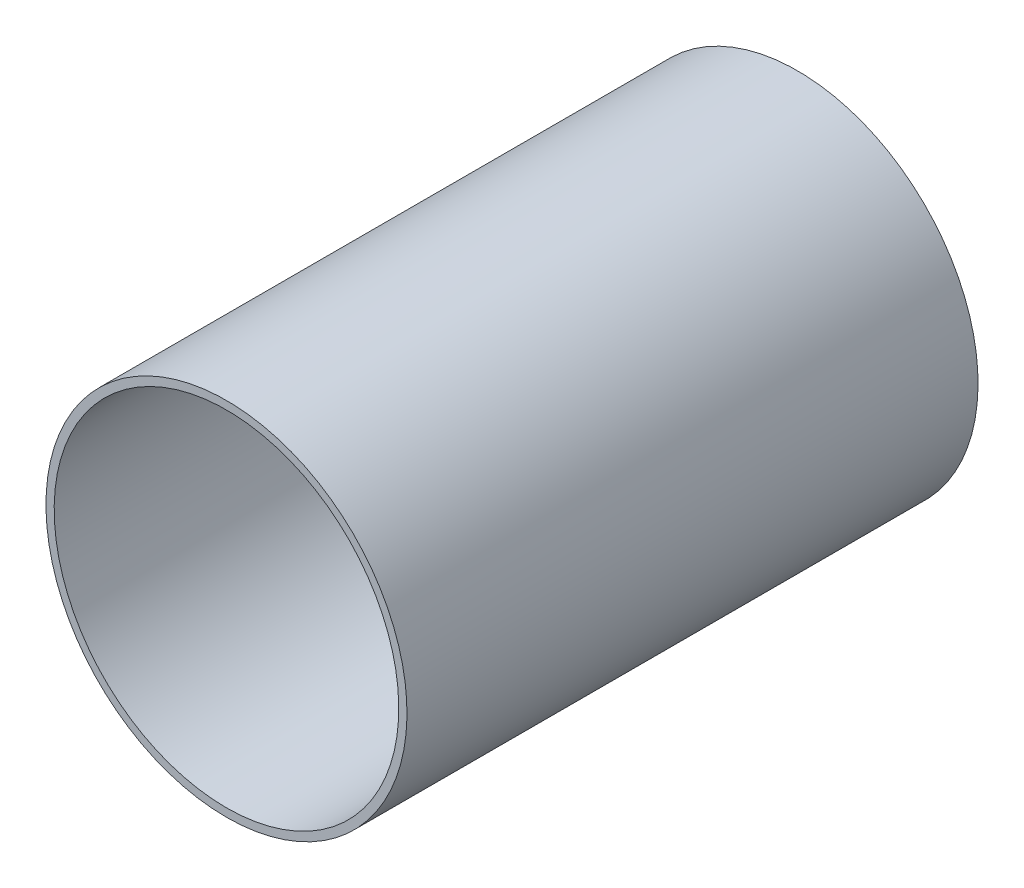
ISO-10303-21;
HEADER;
FILE_DESCRIPTION(('STEP AP214'),'2;1');
FILE_NAME('part.step','',(''),(''),'','','');
FILE_SCHEMA(('AUTOMOTIVE_DESIGN { 1 0 10303 214 1 1 1 1 }'));
ENDSEC;
DATA;
#1=APPLICATION_CONTEXT('core data for automotive mechanical design processes');
#2=APPLICATION_PROTOCOL_DEFINITION('international standard','automotive_design',2000,#1);
#3=PRODUCT_CONTEXT('',#1,'mechanical');
#4=PRODUCT('Part','Part','',(#3));
#5=PRODUCT_RELATED_PRODUCT_CATEGORY('part','',(#4));
#6=PRODUCT_DEFINITION_FORMATION('','',#4);
#7=PRODUCT_DEFINITION_CONTEXT('part definition',#1,'design');
#8=PRODUCT_DEFINITION('design','',#6,#7);
#9=PRODUCT_DEFINITION_SHAPE('','',#8);
#10=(LENGTH_UNIT() NAMED_UNIT(*) SI_UNIT(.MILLI.,.METRE.));
#11=(NAMED_UNIT(*) PLANE_ANGLE_UNIT() SI_UNIT($,.RADIAN.));
#12=(NAMED_UNIT(*) SI_UNIT($,.STERADIAN.) SOLID_ANGLE_UNIT());
#13=UNCERTAINTY_MEASURE_WITH_UNIT(LENGTH_MEASURE(1.E-05),#10,'distance_accuracy_value','');
#14=(GEOMETRIC_REPRESENTATION_CONTEXT(3) GLOBAL_UNCERTAINTY_ASSIGNED_CONTEXT((#13)) GLOBAL_UNIT_ASSIGNED_CONTEXT((#10,
#11,#12)) REPRESENTATION_CONTEXT('',''));
#15=CARTESIAN_POINT('',(0.,0.,0.));
#16=DIRECTION('',(0.,0.,1.));
#17=DIRECTION('',(1.,0.,0.));
#18=AXIS2_PLACEMENT_3D('',#15,#16,#17);
#19=CARTESIAN_POINT('',(139.452,-114.284,-0.045));
#20=DIRECTION('',(0.,0.,-1.));
#21=DIRECTION('',(0.,-1.,0.));
#22=AXIS2_PLACEMENT_3D('',#19,#20,#21);
#23=CYLINDRICAL_SURFACE('',#22,0.525);
#24=CARTESIAN_POINT('',(139.452,-114.284,-0.035));
#25=DIRECTION('',(0.,0.,-1.));
#26=DIRECTION('',(0.,-1.,0.));
#27=AXIS2_PLACEMENT_3D('',#24,#25,#26);
#28=CIRCLE('',#27,0.525);
#29=CARTESIAN_POINT('',(139.452,-114.809,-0.035));
#30=VERTEX_POINT('',#29);
#31=EDGE_CURVE('E64',#30,#30,#28,.T.);
#32=ORIENTED_EDGE('',*,*,#31,.T.);
#33=DIRECTION('',(0.,0.,1.));
#34=VECTOR('',#33,1.);
#35=CARTESIAN_POINT('',(139.452,-114.809,-0.045));
#36=LINE('',#35,#34);
#37=CARTESIAN_POINT('',(139.452,-114.809,1.705));
#38=VERTEX_POINT('',#37);
#39=EDGE_CURVE('E11',#30,#38,#36,.T.);
#40=ORIENTED_EDGE('',*,*,#39,.T.);
#41=CARTESIAN_POINT('',(139.452,-114.284,1.705));
#42=DIRECTION('',(0.,0.,-1.));
#43=DIRECTION('',(0.,-1.,0.));
#44=AXIS2_PLACEMENT_3D('',#41,#42,#43);
#45=CIRCLE('',#44,0.525);
#46=EDGE_CURVE('E25',#38,#38,#45,.T.);
#47=ORIENTED_EDGE('',*,*,#46,.F.);
#48=ORIENTED_EDGE('',*,*,#39,.F.);
#49=EDGE_LOOP('',(#32,#40,#47,#48));
#50=FACE_BOUND('',#49,.T.);
#51=ADVANCED_FACE('F17',(#50),#23,.F.);
#52=CARTESIAN_POINT('',(139.452,-114.834,1.705));
#53=DIRECTION('',(0.,0.,1.));
#54=DIRECTION('',(1.,0.,0.));
#55=AXIS2_PLACEMENT_3D('',#52,#53,#54);
#56=PLANE('',#55);
#57=ORIENTED_EDGE('',*,*,#46,.T.);
#58=EDGE_LOOP('',(#57));
#59=FACE_BOUND('',#58,.T.);
#60=CARTESIAN_POINT('',(139.452,-114.284,1.705));
#61=DIRECTION('',(0.,0.,1.));
#62=DIRECTION('',(0.,-1.,0.));
#63=AXIS2_PLACEMENT_3D('',#60,#61,#62);
#64=CIRCLE('',#63,0.55);
#65=CARTESIAN_POINT('',(139.452,-114.834,1.705));
#66=VERTEX_POINT('',#65);
#67=EDGE_CURVE('E56',#66,#66,#64,.T.);
#68=ORIENTED_EDGE('',*,*,#67,.T.);
#69=EDGE_LOOP('',(#68));
#70=FACE_BOUND('',#69,.T.);
#71=ADVANCED_FACE('F76',(#59,#70),#56,.T.);
#72=CARTESIAN_POINT('',(139.452,-114.834,-0.035));
#73=DIRECTION('',(0.,0.,1.));
#74=DIRECTION('',(1.,0.,0.));
#75=AXIS2_PLACEMENT_3D('',#72,#73,#74);
#76=PLANE('',#75);
#77=ORIENTED_EDGE('',*,*,#31,.F.);
#78=EDGE_LOOP('',(#77));
#79=FACE_BOUND('',#78,.T.);
#80=CARTESIAN_POINT('',(139.452,-114.284,-0.035));
#81=DIRECTION('',(0.,0.,1.));
#82=DIRECTION('',(0.,-1.,0.));
#83=AXIS2_PLACEMENT_3D('',#80,#81,#82);
#84=CIRCLE('',#83,0.55);
#85=CARTESIAN_POINT('',(139.452,-114.834,-0.035));
#86=VERTEX_POINT('',#85);
#87=EDGE_CURVE('E55',#86,#86,#84,.T.);
#88=ORIENTED_EDGE('',*,*,#87,.F.);
#89=EDGE_LOOP('',(#88));
#90=FACE_BOUND('',#89,.T.);
#91=ADVANCED_FACE('F84',(#79,#90),#76,.F.);
#92=CARTESIAN_POINT('',(139.452,-114.284,-0.035));
#93=DIRECTION('',(0.,0.,-1.));
#94=DIRECTION('',(0.,-1.,0.));
#95=AXIS2_PLACEMENT_3D('',#92,#93,#94);
#96=CYLINDRICAL_SURFACE('',#95,0.55);
#97=ORIENTED_EDGE('',*,*,#87,.T.);
#98=DIRECTION('',(0.,0.,1.));
#99=VECTOR('',#98,1.);
#100=CARTESIAN_POINT('',(139.452,-114.834,-0.035));
#101=LINE('',#100,#99);
#102=EDGE_CURVE('E52',#86,#66,#101,.T.);
#103=ORIENTED_EDGE('',*,*,#102,.T.);
#104=ORIENTED_EDGE('',*,*,#67,.F.);
#105=ORIENTED_EDGE('',*,*,#102,.F.);
#106=EDGE_LOOP('',(#97,#103,#104,#105));
#107=FACE_BOUND('',#106,.T.);
#108=ADVANCED_FACE('F53',(#107),#96,.T.);
#109=CLOSED_SHELL('',(#51,#71,#91,#108));
#110=MANIFOLD_SOLID_BREP('B1',#109);
#111=ADVANCED_BREP_SHAPE_REPRESENTATION('',(#18,#110),#14);
#112=SHAPE_DEFINITION_REPRESENTATION(#9,#111);
ENDSEC;
END-ISO-10303-21;
